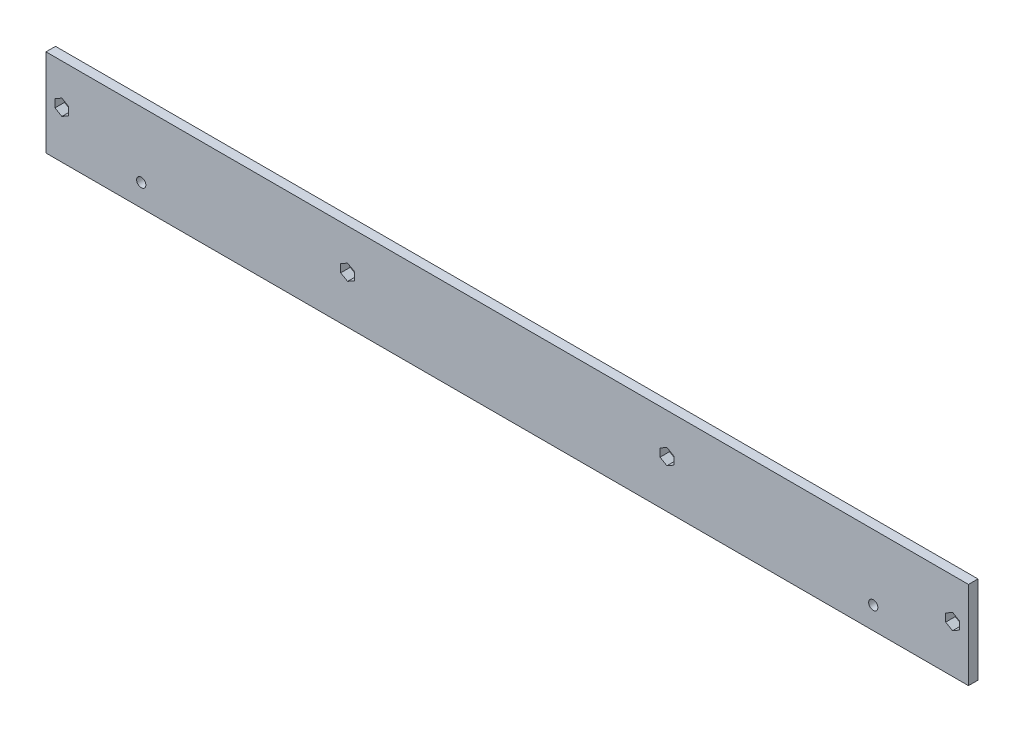
ISO-10303-21;
HEADER;
FILE_DESCRIPTION(('STEP AP214'),'2;1');
FILE_NAME('part.step','',(''),(''),'','','');
FILE_SCHEMA(('AUTOMOTIVE_DESIGN { 1 0 10303 214 1 1 1 1 }'));
ENDSEC;
DATA;
#1=APPLICATION_CONTEXT('core data for automotive mechanical design processes');
#2=APPLICATION_PROTOCOL_DEFINITION('international standard','automotive_design',2000,#1);
#3=PRODUCT_CONTEXT('',#1,'mechanical');
#4=PRODUCT('Part','Part','',(#3));
#5=PRODUCT_RELATED_PRODUCT_CATEGORY('part','',(#4));
#6=PRODUCT_DEFINITION_FORMATION('','',#4);
#7=PRODUCT_DEFINITION_CONTEXT('part definition',#1,'design');
#8=PRODUCT_DEFINITION('design','',#6,#7);
#9=PRODUCT_DEFINITION_SHAPE('','',#8);
#10=(LENGTH_UNIT() NAMED_UNIT(*) SI_UNIT(.MILLI.,.METRE.));
#11=(NAMED_UNIT(*) PLANE_ANGLE_UNIT() SI_UNIT($,.RADIAN.));
#12=(NAMED_UNIT(*) SI_UNIT($,.STERADIAN.) SOLID_ANGLE_UNIT());
#13=UNCERTAINTY_MEASURE_WITH_UNIT(LENGTH_MEASURE(1.E-05),#10,'distance_accuracy_value','');
#14=(GEOMETRIC_REPRESENTATION_CONTEXT(3) GLOBAL_UNCERTAINTY_ASSIGNED_CONTEXT((#13)) GLOBAL_UNIT_ASSIGNED_CONTEXT((#10,
#11,#12)) REPRESENTATION_CONTEXT('',''));
#15=CARTESIAN_POINT('',(0.,0.,0.));
#16=DIRECTION('',(0.,0.,1.));
#17=DIRECTION('',(1.,0.,0.));
#18=AXIS2_PLACEMENT_3D('',#15,#16,#17);
#19=CARTESIAN_POINT('',(-3.92699081749999,0.,3.));
#20=DIRECTION('',(0.,0.,1.));
#21=DIRECTION('',(1.,0.,0.));
#22=AXIS2_PLACEMENT_3D('',#19,#20,#21);
#23=PLANE('',#22);
#24=DIRECTION('',(-0.866025403784439,-0.5,0.));
#25=VECTOR('',#24,1.);
#26=CARTESIAN_POINT('',(3.23807269196111,13.75,3.));
#27=LINE('',#26,#25);
#28=CARTESIAN_POINT('',(3.23807269196111,13.75,3.));
#29=VERTEX_POINT('',#28);
#30=CARTESIAN_POINT('',(1.07300918250001,12.5,3.));
#31=VERTEX_POINT('',#30);
#32=EDGE_CURVE('E225',#29,#31,#27,.T.);
#33=ORIENTED_EDGE('',*,*,#32,.T.);
#34=DIRECTION('',(-0.866025403784439,0.5,0.));
#35=VECTOR('',#34,1.);
#36=CARTESIAN_POINT('',(1.07300918250001,12.5,3.));
#37=LINE('',#36,#35);
#38=CARTESIAN_POINT('',(-1.09205432696108,13.75,3.));
#39=VERTEX_POINT('',#38);
#40=EDGE_CURVE('E236',#31,#39,#37,.T.);
#41=ORIENTED_EDGE('',*,*,#40,.T.);
#42=DIRECTION('',(0.,1.,0.));
#43=VECTOR('',#42,1.);
#44=CARTESIAN_POINT('',(-1.09205432696108,13.75,3.));
#45=LINE('',#44,#43);
#46=CARTESIAN_POINT('',(-1.09205432696108,16.25,3.));
#47=VERTEX_POINT('',#46);
#48=EDGE_CURVE('E51',#39,#47,#45,.T.);
#49=ORIENTED_EDGE('',*,*,#48,.T.);
#50=DIRECTION('',(0.866025403784438,0.500000000000001,0.));
#51=VECTOR('',#50,1.);
#52=CARTESIAN_POINT('',(-1.09205432696108,16.25,3.));
#53=LINE('',#52,#51);
#54=CARTESIAN_POINT('',(1.07300918250001,17.5,3.));
#55=VERTEX_POINT('',#54);
#56=EDGE_CURVE('E250',#47,#55,#53,.T.);
#57=ORIENTED_EDGE('',*,*,#56,.T.);
#58=DIRECTION('',(0.866025403784438,-0.500000000000001,0.));
#59=VECTOR('',#58,1.);
#60=CARTESIAN_POINT('',(1.07300918250001,17.5,3.));
#61=LINE('',#60,#59);
#62=CARTESIAN_POINT('',(3.23807269196111,16.25,3.));
#63=VERTEX_POINT('',#62);
#64=EDGE_CURVE('E253',#55,#63,#61,.T.);
#65=ORIENTED_EDGE('',*,*,#64,.T.);
#66=DIRECTION('',(0.,-1.,0.));
#67=VECTOR('',#66,1.);
#68=CARTESIAN_POINT('',(3.23807269196111,16.25,3.));
#69=LINE('',#68,#67);
#70=EDGE_CURVE('E233',#63,#29,#69,.T.);
#71=ORIENTED_EDGE('',*,*,#70,.T.);
#72=EDGE_LOOP('',(#33,#41,#49,#57,#65,#71));
#73=FACE_BOUND('',#72,.T.);
#74=DIRECTION('',(-0.866025403784438,0.500000000000001,0.));
#75=VECTOR('',#74,1.);
#76=CARTESIAN_POINT('',(91.0730091825,12.5,3.));
#77=LINE('',#76,#75);
#78=CARTESIAN_POINT('',(91.0730091825,12.5,3.));
#79=VERTEX_POINT('',#78);
#80=CARTESIAN_POINT('',(88.9079456730389,13.75,3.));
#81=VERTEX_POINT('',#80);
#82=EDGE_CURVE('E278',#79,#81,#77,.T.);
#83=ORIENTED_EDGE('',*,*,#82,.T.);
#84=DIRECTION('',(0.,1.,0.));
#85=VECTOR('',#84,1.);
#86=CARTESIAN_POINT('',(88.9079456730389,13.75,3.));
#87=LINE('',#86,#85);
#88=CARTESIAN_POINT('',(88.9079456730389,16.25,3.));
#89=VERTEX_POINT('',#88);
#90=EDGE_CURVE('E281',#81,#89,#87,.T.);
#91=ORIENTED_EDGE('',*,*,#90,.T.);
#92=DIRECTION('',(0.866025403784439,0.5,0.));
#93=VECTOR('',#92,1.);
#94=CARTESIAN_POINT('',(88.9079456730389,16.25,3.));
#95=LINE('',#94,#93);
#96=CARTESIAN_POINT('',(91.0730091825,17.5,3.));
#97=VERTEX_POINT('',#96);
#98=EDGE_CURVE('E59',#89,#97,#95,.T.);
#99=ORIENTED_EDGE('',*,*,#98,.T.);
#100=DIRECTION('',(0.866025403784439,-0.499999999999999,0.));
#101=VECTOR('',#100,1.);
#102=CARTESIAN_POINT('',(91.0730091825,17.5,3.));
#103=LINE('',#102,#101);
#104=CARTESIAN_POINT('',(93.2380726919611,16.25,3.));
#105=VERTEX_POINT('',#104);
#106=EDGE_CURVE('E286',#97,#105,#103,.T.);
#107=ORIENTED_EDGE('',*,*,#106,.T.);
#108=DIRECTION('',(0.,-1.,0.));
#109=VECTOR('',#108,1.);
#110=CARTESIAN_POINT('',(93.2380726919611,16.25,3.));
#111=LINE('',#110,#109);
#112=CARTESIAN_POINT('',(93.2380726919611,13.75,3.));
#113=VERTEX_POINT('',#112);
#114=EDGE_CURVE('E289',#105,#113,#111,.T.);
#115=ORIENTED_EDGE('',*,*,#114,.T.);
#116=DIRECTION('',(-0.866025403784439,-0.499999999999999,0.));
#117=VECTOR('',#116,1.);
#118=CARTESIAN_POINT('',(93.2380726919611,13.75,3.));
#119=LINE('',#118,#117);
#120=EDGE_CURVE('E292',#113,#79,#119,.T.);
#121=ORIENTED_EDGE('',*,*,#120,.T.);
#122=EDGE_LOOP('',(#83,#91,#99,#107,#115,#121));
#123=FACE_BOUND('',#122,.T.);
#124=DIRECTION('',(-0.866025403784437,0.500000000000002,0.));
#125=VECTOR('',#124,1.);
#126=CARTESIAN_POINT('',(191.6703296775,12.5,3.));
#127=LINE('',#126,#125);
#128=CARTESIAN_POINT('',(191.6703296775,12.5,3.));
#129=VERTEX_POINT('',#128);
#130=CARTESIAN_POINT('',(189.505266168039,13.75,3.));
#131=VERTEX_POINT('',#130);
#132=EDGE_CURVE('E324',#129,#131,#127,.T.);
#133=ORIENTED_EDGE('',*,*,#132,.T.);
#134=DIRECTION('',(0.,1.,0.));
#135=VECTOR('',#134,1.);
#136=CARTESIAN_POINT('',(189.505266168039,13.75,3.));
#137=LINE('',#136,#135);
#138=CARTESIAN_POINT('',(189.505266168039,16.2500000000001,3.));
#139=VERTEX_POINT('',#138);
#140=EDGE_CURVE('E327',#131,#139,#137,.T.);
#141=ORIENTED_EDGE('',*,*,#140,.T.);
#142=DIRECTION('',(0.866025403784441,0.499999999999996,0.));
#143=VECTOR('',#142,1.);
#144=CARTESIAN_POINT('',(189.505266168039,16.2500000000001,3.));
#145=LINE('',#144,#143);
#146=CARTESIAN_POINT('',(191.6703296775,17.5000000000001,3.));
#147=VERTEX_POINT('',#146);
#148=EDGE_CURVE('E331',#139,#147,#145,.T.);
#149=ORIENTED_EDGE('',*,*,#148,.T.);
#150=DIRECTION('',(0.866025403784438,-0.500000000000001,0.));
#151=VECTOR('',#150,1.);
#152=CARTESIAN_POINT('',(191.6703296775,17.5000000000001,3.));
#153=LINE('',#152,#151);
#154=CARTESIAN_POINT('',(193.835393186961,16.2500000000001,3.));
#155=VERTEX_POINT('',#154);
#156=EDGE_CURVE('E334',#147,#155,#153,.T.);
#157=ORIENTED_EDGE('',*,*,#156,.T.);
#158=DIRECTION('',(0.,-1.,0.));
#159=VECTOR('',#158,1.);
#160=CARTESIAN_POINT('',(193.835393186961,16.2500000000001,3.));
#161=LINE('',#160,#159);
#162=CARTESIAN_POINT('',(193.835393186961,13.7500000000001,3.));
#163=VERTEX_POINT('',#162);
#164=EDGE_CURVE('E337',#155,#163,#161,.T.);
#165=ORIENTED_EDGE('',*,*,#164,.T.);
#166=DIRECTION('',(-0.86602540378444,-0.499999999999998,0.));
#167=VECTOR('',#166,1.);
#168=CARTESIAN_POINT('',(193.835393186961,13.7500000000001,3.));
#169=LINE('',#168,#167);
#170=EDGE_CURVE('E340',#163,#129,#169,.T.);
#171=ORIENTED_EDGE('',*,*,#170,.T.);
#172=EDGE_LOOP('',(#133,#141,#149,#157,#165,#171));
#173=FACE_BOUND('',#172,.T.);
#174=DIRECTION('',(-0.866025403784439,0.499999999999999,0.));
#175=VECTOR('',#174,1.);
#176=CARTESIAN_POINT('',(281.6703296775,12.5000000000001,3.));
#177=LINE('',#176,#175);
#178=CARTESIAN_POINT('',(281.6703296775,12.5000000000001,3.));
#179=VERTEX_POINT('',#178);
#180=CARTESIAN_POINT('',(279.505266168039,13.7500000000001,3.));
#181=VERTEX_POINT('',#180);
#182=EDGE_CURVE('E372',#179,#181,#177,.T.);
#183=ORIENTED_EDGE('',*,*,#182,.T.);
#184=DIRECTION('',(0.,1.,0.));
#185=VECTOR('',#184,1.);
#186=CARTESIAN_POINT('',(279.505266168039,13.7500000000001,3.));
#187=LINE('',#186,#185);
#188=CARTESIAN_POINT('',(279.505266168039,16.2499999999999,3.));
#189=VERTEX_POINT('',#188);
#190=EDGE_CURVE('E375',#181,#189,#187,.T.);
#191=ORIENTED_EDGE('',*,*,#190,.T.);
#192=DIRECTION('',(0.866025403784441,0.499999999999996,0.));
#193=VECTOR('',#192,1.);
#194=CARTESIAN_POINT('',(279.505266168039,16.2499999999999,3.));
#195=LINE('',#194,#193);
#196=CARTESIAN_POINT('',(281.6703296775,17.4999999999999,3.));
#197=VERTEX_POINT('',#196);
#198=EDGE_CURVE('E379',#189,#197,#195,.T.);
#199=ORIENTED_EDGE('',*,*,#198,.T.);
#200=DIRECTION('',(0.866025403784436,-0.500000000000004,0.));
#201=VECTOR('',#200,1.);
#202=CARTESIAN_POINT('',(281.6703296775,17.4999999999999,3.));
#203=LINE('',#202,#201);
#204=CARTESIAN_POINT('',(283.835393186961,16.2499999999999,3.));
#205=VERTEX_POINT('',#204);
#206=EDGE_CURVE('E382',#197,#205,#203,.T.);
#207=ORIENTED_EDGE('',*,*,#206,.T.);
#208=DIRECTION('',(0.,-1.,0.));
#209=VECTOR('',#208,1.);
#210=CARTESIAN_POINT('',(283.835393186961,16.2499999999999,3.));
#211=LINE('',#210,#209);
#212=CARTESIAN_POINT('',(283.835393186961,13.7500000000001,3.));
#213=VERTEX_POINT('',#212);
#214=EDGE_CURVE('E385',#205,#213,#211,.T.);
#215=ORIENTED_EDGE('',*,*,#214,.T.);
#216=DIRECTION('',(-0.866025403784438,-0.500000000000001,0.));
#217=VECTOR('',#216,1.);
#218=CARTESIAN_POINT('',(283.835393186961,13.7500000000001,3.));
#219=LINE('',#218,#217);
#220=EDGE_CURVE('E388',#213,#179,#219,.T.);
#221=ORIENTED_EDGE('',*,*,#220,.T.);
#222=EDGE_LOOP('',(#183,#191,#199,#207,#215,#221));
#223=FACE_BOUND('',#222,.T.);
#224=CARTESIAN_POINT('',(256.6703296775,7.,3.));
#225=DIRECTION('',(0.,0.,1.));
#226=DIRECTION('',(1.,0.,0.));
#227=AXIS2_PLACEMENT_3D('',#224,#225,#226);
#228=CIRCLE('',#227,1.45);
#229=CARTESIAN_POINT('',(258.1203296775,7.,3.));
#230=VERTEX_POINT('',#229);
#231=EDGE_CURVE('E270',#230,#230,#228,.T.);
#232=ORIENTED_EDGE('',*,*,#231,.F.);
#233=EDGE_LOOP('',(#232));
#234=FACE_BOUND('',#233,.T.);
#235=CARTESIAN_POINT('',(26.0730091825,7.,3.));
#236=DIRECTION('',(0.,0.,1.));
#237=DIRECTION('',(1.,0.,0.));
#238=AXIS2_PLACEMENT_3D('',#235,#236,#237);
#239=CIRCLE('',#238,1.45);
#240=CARTESIAN_POINT('',(27.5230091825,7.,3.));
#241=VERTEX_POINT('',#240);
#242=EDGE_CURVE('E422',#241,#241,#239,.T.);
#243=ORIENTED_EDGE('',*,*,#242,.F.);
#244=EDGE_LOOP('',(#243));
#245=FACE_BOUND('',#244,.T.);
#246=DIRECTION('',(0.,-1.,0.));
#247=VECTOR('',#246,1.);
#248=CARTESIAN_POINT('',(-3.92699081749999,27.625,3.));
#249=LINE('',#248,#247);
#250=CARTESIAN_POINT('',(-3.92699081749999,27.625,3.));
#251=VERTEX_POINT('',#250);
#252=CARTESIAN_POINT('',(-3.92699081749999,0.,3.));
#253=VERTEX_POINT('',#252);
#254=EDGE_CURVE('E431',#251,#253,#249,.T.);
#255=ORIENTED_EDGE('',*,*,#254,.T.);
#256=DIRECTION('',(1.,0.,0.));
#257=VECTOR('',#256,1.);
#258=CARTESIAN_POINT('',(-3.92699081749999,0.,3.));
#259=LINE('',#258,#257);
#260=CARTESIAN_POINT('',(286.6703296775,0.,3.));
#261=VERTEX_POINT('',#260);
#262=EDGE_CURVE('E434',#253,#261,#259,.T.);
#263=ORIENTED_EDGE('',*,*,#262,.T.);
#264=DIRECTION('',(0.,1.,0.));
#265=VECTOR('',#264,1.);
#266=CARTESIAN_POINT('',(286.6703296775,27.625,3.));
#267=LINE('',#266,#265);
#268=CARTESIAN_POINT('',(286.6703296775,27.625,3.));
#269=VERTEX_POINT('',#268);
#270=EDGE_CURVE('E437',#261,#269,#267,.T.);
#271=ORIENTED_EDGE('',*,*,#270,.T.);
#272=DIRECTION('',(-1.,0.,0.));
#273=VECTOR('',#272,1.);
#274=CARTESIAN_POINT('',(-3.92699081749999,27.625,3.));
#275=LINE('',#274,#273);
#276=EDGE_CURVE('E439',#269,#251,#275,.T.);
#277=ORIENTED_EDGE('',*,*,#276,.T.);
#278=EDGE_LOOP('',(#255,#263,#271,#277));
#279=FACE_BOUND('',#278,.T.);
#280=ADVANCED_FACE('F36',(#73,#123,#173,#223,#234,#245,#279),#23,.T.);
#281=CARTESIAN_POINT('',(-3.92699081749999,0.,0.));
#282=DIRECTION('',(0.,0.,1.));
#283=DIRECTION('',(1.,0.,0.));
#284=AXIS2_PLACEMENT_3D('',#281,#282,#283);
#285=PLANE('',#284);
#286=DIRECTION('',(-0.866025403784439,0.5,0.));
#287=VECTOR('',#286,1.);
#288=CARTESIAN_POINT('',(1.07300918250001,12.5,0.));
#289=LINE('',#288,#287);
#290=CARTESIAN_POINT('',(1.07300918250001,12.5,0.));
#291=VERTEX_POINT('',#290);
#292=CARTESIAN_POINT('',(-1.09205432696108,13.75,0.));
#293=VERTEX_POINT('',#292);
#294=EDGE_CURVE('E257',#291,#293,#289,.T.);
#295=ORIENTED_EDGE('',*,*,#294,.F.);
#296=DIRECTION('',(-0.866025403784439,-0.5,0.));
#297=VECTOR('',#296,1.);
#298=CARTESIAN_POINT('',(3.23807269196111,13.75,0.));
#299=LINE('',#298,#297);
#300=CARTESIAN_POINT('',(3.23807269196111,13.75,0.));
#301=VERTEX_POINT('',#300);
#302=EDGE_CURVE('E228',#301,#291,#299,.T.);
#303=ORIENTED_EDGE('',*,*,#302,.F.);
#304=DIRECTION('',(0.,-1.,0.));
#305=VECTOR('',#304,1.);
#306=CARTESIAN_POINT('',(3.23807269196111,16.25,0.));
#307=LINE('',#306,#305);
#308=CARTESIAN_POINT('',(3.23807269196111,16.25,0.));
#309=VERTEX_POINT('',#308);
#310=EDGE_CURVE('E243',#309,#301,#307,.T.);
#311=ORIENTED_EDGE('',*,*,#310,.F.);
#312=DIRECTION('',(0.866025403784438,-0.500000000000001,0.));
#313=VECTOR('',#312,1.);
#314=CARTESIAN_POINT('',(1.07300918250001,17.5,0.));
#315=LINE('',#314,#313);
#316=CARTESIAN_POINT('',(1.07300918250001,17.5,0.));
#317=VERTEX_POINT('',#316);
#318=EDGE_CURVE('E246',#317,#309,#315,.T.);
#319=ORIENTED_EDGE('',*,*,#318,.F.);
#320=DIRECTION('',(0.866025403784438,0.500000000000001,0.));
#321=VECTOR('',#320,1.);
#322=CARTESIAN_POINT('',(-1.09205432696108,16.25,0.));
#323=LINE('',#322,#321);
#324=CARTESIAN_POINT('',(-1.09205432696108,16.25,0.));
#325=VERTEX_POINT('',#324);
#326=EDGE_CURVE('E263',#325,#317,#323,.T.);
#327=ORIENTED_EDGE('',*,*,#326,.F.);
#328=DIRECTION('',(0.,1.,0.));
#329=VECTOR('',#328,1.);
#330=CARTESIAN_POINT('',(-1.09205432696108,13.75,0.));
#331=LINE('',#330,#329);
#332=EDGE_CURVE('E260',#293,#325,#331,.T.);
#333=ORIENTED_EDGE('',*,*,#332,.F.);
#334=EDGE_LOOP('',(#295,#303,#311,#319,#327,#333));
#335=FACE_BOUND('',#334,.T.);
#336=DIRECTION('',(0.,1.,0.));
#337=VECTOR('',#336,1.);
#338=CARTESIAN_POINT('',(88.9079456730389,13.75,0.));
#339=LINE('',#338,#337);
#340=CARTESIAN_POINT('',(88.9079456730389,13.75,0.));
#341=VERTEX_POINT('',#340);
#342=CARTESIAN_POINT('',(88.9079456730389,16.25,0.));
#343=VERTEX_POINT('',#342);
#344=EDGE_CURVE('E298',#341,#343,#339,.T.);
#345=ORIENTED_EDGE('',*,*,#344,.F.);
#346=DIRECTION('',(-0.866025403784438,0.500000000000001,0.));
#347=VECTOR('',#346,1.);
#348=CARTESIAN_POINT('',(91.0730091825,12.5,0.));
#349=LINE('',#348,#347);
#350=CARTESIAN_POINT('',(91.0730091825,12.5,0.));
#351=VERTEX_POINT('',#350);
#352=EDGE_CURVE('E296',#351,#341,#349,.T.);
#353=ORIENTED_EDGE('',*,*,#352,.F.);
#354=DIRECTION('',(-0.866025403784439,-0.499999999999999,0.));
#355=VECTOR('',#354,1.);
#356=CARTESIAN_POINT('',(93.2380726919611,13.75,0.));
#357=LINE('',#356,#355);
#358=CARTESIAN_POINT('',(93.2380726919611,13.75,0.));
#359=VERTEX_POINT('',#358);
#360=EDGE_CURVE('E282',#359,#351,#357,.T.);
#361=ORIENTED_EDGE('',*,*,#360,.F.);
#362=DIRECTION('',(0.,-1.,0.));
#363=VECTOR('',#362,1.);
#364=CARTESIAN_POINT('',(93.2380726919611,16.25,0.));
#365=LINE('',#364,#363);
#366=CARTESIAN_POINT('',(93.2380726919611,16.25,0.));
#367=VERTEX_POINT('',#366);
#368=EDGE_CURVE('E308',#367,#359,#365,.T.);
#369=ORIENTED_EDGE('',*,*,#368,.F.);
#370=DIRECTION('',(0.866025403784439,-0.499999999999999,0.));
#371=VECTOR('',#370,1.);
#372=CARTESIAN_POINT('',(91.0730091825,17.5,0.));
#373=LINE('',#372,#371);
#374=CARTESIAN_POINT('',(91.0730091825,17.5,0.));
#375=VERTEX_POINT('',#374);
#376=EDGE_CURVE('E305',#375,#367,#373,.T.);
#377=ORIENTED_EDGE('',*,*,#376,.F.);
#378=DIRECTION('',(0.866025403784439,0.5,0.));
#379=VECTOR('',#378,1.);
#380=CARTESIAN_POINT('',(88.9079456730389,16.25,0.));
#381=LINE('',#380,#379);
#382=EDGE_CURVE('E302',#343,#375,#381,.T.);
#383=ORIENTED_EDGE('',*,*,#382,.F.);
#384=EDGE_LOOP('',(#345,#353,#361,#369,#377,#383));
#385=FACE_BOUND('',#384,.T.);
#386=DIRECTION('',(0.,1.,0.));
#387=VECTOR('',#386,1.);
#388=CARTESIAN_POINT('',(189.505266168039,13.75,0.));
#389=LINE('',#388,#387);
#390=CARTESIAN_POINT('',(189.505266168039,13.75,0.));
#391=VERTEX_POINT('',#390);
#392=CARTESIAN_POINT('',(189.505266168039,16.2500000000001,0.));
#393=VERTEX_POINT('',#392);
#394=EDGE_CURVE('E346',#391,#393,#389,.T.);
#395=ORIENTED_EDGE('',*,*,#394,.F.);
#396=DIRECTION('',(-0.866025403784437,0.500000000000002,0.));
#397=VECTOR('',#396,1.);
#398=CARTESIAN_POINT('',(191.6703296775,12.5,0.));
#399=LINE('',#398,#397);
#400=CARTESIAN_POINT('',(191.6703296775,12.5,0.));
#401=VERTEX_POINT('',#400);
#402=EDGE_CURVE('E344',#401,#391,#399,.T.);
#403=ORIENTED_EDGE('',*,*,#402,.F.);
#404=DIRECTION('',(-0.86602540378444,-0.499999999999998,0.));
#405=VECTOR('',#404,1.);
#406=CARTESIAN_POINT('',(193.835393186961,13.7500000000001,0.));
#407=LINE('',#406,#405);
#408=CARTESIAN_POINT('',(193.835393186961,13.7500000000001,0.));
#409=VERTEX_POINT('',#408);
#410=EDGE_CURVE('E328',#409,#401,#407,.T.);
#411=ORIENTED_EDGE('',*,*,#410,.F.);
#412=DIRECTION('',(0.,-1.,0.));
#413=VECTOR('',#412,1.);
#414=CARTESIAN_POINT('',(193.835393186961,16.2500000000001,0.));
#415=LINE('',#414,#413);
#416=CARTESIAN_POINT('',(193.835393186961,16.2500000000001,0.));
#417=VERTEX_POINT('',#416);
#418=EDGE_CURVE('E356',#417,#409,#415,.T.);
#419=ORIENTED_EDGE('',*,*,#418,.F.);
#420=DIRECTION('',(0.866025403784438,-0.500000000000001,0.));
#421=VECTOR('',#420,1.);
#422=CARTESIAN_POINT('',(191.6703296775,17.5000000000001,0.));
#423=LINE('',#422,#421);
#424=CARTESIAN_POINT('',(191.6703296775,17.5000000000001,0.));
#425=VERTEX_POINT('',#424);
#426=EDGE_CURVE('E353',#425,#417,#423,.T.);
#427=ORIENTED_EDGE('',*,*,#426,.F.);
#428=DIRECTION('',(0.866025403784441,0.499999999999996,0.));
#429=VECTOR('',#428,1.);
#430=CARTESIAN_POINT('',(189.505266168039,16.2500000000001,0.));
#431=LINE('',#430,#429);
#432=EDGE_CURVE('E350',#393,#425,#431,.T.);
#433=ORIENTED_EDGE('',*,*,#432,.F.);
#434=EDGE_LOOP('',(#395,#403,#411,#419,#427,#433));
#435=FACE_BOUND('',#434,.T.);
#436=DIRECTION('',(0.,1.,0.));
#437=VECTOR('',#436,1.);
#438=CARTESIAN_POINT('',(279.505266168039,13.7500000000001,0.));
#439=LINE('',#438,#437);
#440=CARTESIAN_POINT('',(279.505266168039,13.7500000000001,0.));
#441=VERTEX_POINT('',#440);
#442=CARTESIAN_POINT('',(279.505266168039,16.2499999999999,0.));
#443=VERTEX_POINT('',#442);
#444=EDGE_CURVE('E394',#441,#443,#439,.T.);
#445=ORIENTED_EDGE('',*,*,#444,.F.);
#446=DIRECTION('',(-0.866025403784439,0.499999999999999,0.));
#447=VECTOR('',#446,1.);
#448=CARTESIAN_POINT('',(281.6703296775,12.5000000000001,0.));
#449=LINE('',#448,#447);
#450=CARTESIAN_POINT('',(281.6703296775,12.5000000000001,0.));
#451=VERTEX_POINT('',#450);
#452=EDGE_CURVE('E392',#451,#441,#449,.T.);
#453=ORIENTED_EDGE('',*,*,#452,.F.);
#454=DIRECTION('',(-0.866025403784438,-0.500000000000001,0.));
#455=VECTOR('',#454,1.);
#456=CARTESIAN_POINT('',(283.835393186961,13.7500000000001,0.));
#457=LINE('',#456,#455);
#458=CARTESIAN_POINT('',(283.835393186961,13.7500000000001,0.));
#459=VERTEX_POINT('',#458);
#460=EDGE_CURVE('E376',#459,#451,#457,.T.);
#461=ORIENTED_EDGE('',*,*,#460,.F.);
#462=DIRECTION('',(0.,-1.,0.));
#463=VECTOR('',#462,1.);
#464=CARTESIAN_POINT('',(283.835393186961,16.2499999999999,0.));
#465=LINE('',#464,#463);
#466=CARTESIAN_POINT('',(283.835393186961,16.2499999999999,0.));
#467=VERTEX_POINT('',#466);
#468=EDGE_CURVE('E403',#467,#459,#465,.T.);
#469=ORIENTED_EDGE('',*,*,#468,.F.);
#470=DIRECTION('',(0.866025403784436,-0.500000000000004,0.));
#471=VECTOR('',#470,1.);
#472=CARTESIAN_POINT('',(281.6703296775,17.4999999999999,0.));
#473=LINE('',#472,#471);
#474=CARTESIAN_POINT('',(281.6703296775,17.4999999999999,0.));
#475=VERTEX_POINT('',#474);
#476=EDGE_CURVE('E400',#475,#467,#473,.T.);
#477=ORIENTED_EDGE('',*,*,#476,.F.);
#478=DIRECTION('',(0.866025403784441,0.499999999999996,0.));
#479=VECTOR('',#478,1.);
#480=CARTESIAN_POINT('',(279.505266168039,16.2499999999999,0.));
#481=LINE('',#480,#479);
#482=EDGE_CURVE('E397',#443,#475,#481,.T.);
#483=ORIENTED_EDGE('',*,*,#482,.F.);
#484=EDGE_LOOP('',(#445,#453,#461,#469,#477,#483));
#485=FACE_BOUND('',#484,.T.);
#486=CARTESIAN_POINT('',(256.6703296775,7.,0.));
#487=DIRECTION('',(0.,0.,1.));
#488=DIRECTION('',(1.,0.,0.));
#489=AXIS2_PLACEMENT_3D('',#486,#487,#488);
#490=CIRCLE('',#489,1.45);
#491=CARTESIAN_POINT('',(258.1203296775,7.,0.));
#492=VERTEX_POINT('',#491);
#493=EDGE_CURVE('E419',#492,#492,#490,.T.);
#494=ORIENTED_EDGE('',*,*,#493,.T.);
#495=EDGE_LOOP('',(#494));
#496=FACE_BOUND('',#495,.T.);
#497=CARTESIAN_POINT('',(26.0730091825,7.,0.));
#498=DIRECTION('',(0.,0.,1.));
#499=DIRECTION('',(1.,0.,0.));
#500=AXIS2_PLACEMENT_3D('',#497,#498,#499);
#501=CIRCLE('',#500,1.45);
#502=CARTESIAN_POINT('',(27.5230091825,7.,0.));
#503=VERTEX_POINT('',#502);
#504=EDGE_CURVE('E425',#503,#503,#501,.T.);
#505=ORIENTED_EDGE('',*,*,#504,.T.);
#506=EDGE_LOOP('',(#505));
#507=FACE_BOUND('',#506,.T.);
#508=DIRECTION('',(0.,-1.,0.));
#509=VECTOR('',#508,1.);
#510=CARTESIAN_POINT('',(-3.92699081749999,27.625,0.));
#511=LINE('',#510,#509);
#512=CARTESIAN_POINT('',(-3.92699081749999,27.625,0.));
#513=VERTEX_POINT('',#512);
#514=CARTESIAN_POINT('',(-3.92699081749999,0.,0.));
#515=VERTEX_POINT('',#514);
#516=EDGE_CURVE('E428',#513,#515,#511,.T.);
#517=ORIENTED_EDGE('',*,*,#516,.F.);
#518=DIRECTION('',(-1.,0.,0.));
#519=VECTOR('',#518,1.);
#520=CARTESIAN_POINT('',(-3.92699081749999,27.625,0.));
#521=LINE('',#520,#519);
#522=CARTESIAN_POINT('',(286.6703296775,27.625,0.));
#523=VERTEX_POINT('',#522);
#524=EDGE_CURVE('E435',#523,#513,#521,.T.);
#525=ORIENTED_EDGE('',*,*,#524,.F.);
#526=DIRECTION('',(0.,1.,0.));
#527=VECTOR('',#526,1.);
#528=CARTESIAN_POINT('',(286.6703296775,27.625,0.));
#529=LINE('',#528,#527);
#530=CARTESIAN_POINT('',(286.6703296775,0.,0.));
#531=VERTEX_POINT('',#530);
#532=EDGE_CURVE('E446',#531,#523,#529,.T.);
#533=ORIENTED_EDGE('',*,*,#532,.F.);
#534=DIRECTION('',(1.,0.,0.));
#535=VECTOR('',#534,1.);
#536=CARTESIAN_POINT('',(-3.92699081749999,0.,0.));
#537=LINE('',#536,#535);
#538=EDGE_CURVE('E444',#515,#531,#537,.T.);
#539=ORIENTED_EDGE('',*,*,#538,.F.);
#540=EDGE_LOOP('',(#517,#525,#533,#539));
#541=FACE_BOUND('',#540,.T.);
#542=ADVANCED_FACE('F464',(#335,#385,#435,#485,#496,#507,#541),#285,.F.);
#543=CARTESIAN_POINT('',(-3.92699081749999,27.625,3.));
#544=DIRECTION('',(1.,0.,0.));
#545=DIRECTION('',(0.,0.,-1.));
#546=AXIS2_PLACEMENT_3D('',#543,#544,#545);
#547=PLANE('',#546);
#548=ORIENTED_EDGE('',*,*,#516,.T.);
#549=DIRECTION('',(0.,0.,-1.));
#550=VECTOR('',#549,1.);
#551=CARTESIAN_POINT('',(-3.92699081749999,0.,3.));
#552=LINE('',#551,#550);
#553=EDGE_CURVE('E11',#253,#515,#552,.T.);
#554=ORIENTED_EDGE('',*,*,#553,.F.);
#555=ORIENTED_EDGE('',*,*,#254,.F.);
#556=DIRECTION('',(0.,0.,-1.));
#557=VECTOR('',#556,1.);
#558=CARTESIAN_POINT('',(-3.92699081749999,27.625,3.));
#559=LINE('',#558,#557);
#560=EDGE_CURVE('E441',#251,#513,#559,.T.);
#561=ORIENTED_EDGE('',*,*,#560,.T.);
#562=EDGE_LOOP('',(#548,#554,#555,#561));
#563=FACE_BOUND('',#562,.T.);
#564=ADVANCED_FACE('F38',(#563),#547,.F.);
#565=CARTESIAN_POINT('',(-3.92699081749999,0.,3.));
#566=DIRECTION('',(0.,1.,0.));
#567=DIRECTION('',(0.,0.,1.));
#568=AXIS2_PLACEMENT_3D('',#565,#566,#567);
#569=PLANE('',#568);
#570=ORIENTED_EDGE('',*,*,#538,.T.);
#571=DIRECTION('',(0.,0.,-1.));
#572=VECTOR('',#571,1.);
#573=CARTESIAN_POINT('',(286.6703296775,0.,3.));
#574=LINE('',#573,#572);
#575=EDGE_CURVE('E44',#261,#531,#574,.T.);
#576=ORIENTED_EDGE('',*,*,#575,.F.);
#577=ORIENTED_EDGE('',*,*,#262,.F.);
#578=ORIENTED_EDGE('',*,*,#553,.T.);
#579=EDGE_LOOP('',(#570,#576,#577,#578));
#580=FACE_BOUND('',#579,.T.);
#581=ADVANCED_FACE('F473',(#580),#569,.F.);
#582=CARTESIAN_POINT('',(286.6703296775,27.625,3.));
#583=DIRECTION('',(-1.,0.,0.));
#584=DIRECTION('',(0.,0.,1.));
#585=AXIS2_PLACEMENT_3D('',#582,#583,#584);
#586=PLANE('',#585);
#587=ORIENTED_EDGE('',*,*,#532,.T.);
#588=DIRECTION('',(0.,0.,-1.));
#589=VECTOR('',#588,1.);
#590=CARTESIAN_POINT('',(286.6703296775,27.625,3.));
#591=LINE('',#590,#589);
#592=EDGE_CURVE('E451',#269,#523,#591,.T.);
#593=ORIENTED_EDGE('',*,*,#592,.F.);
#594=ORIENTED_EDGE('',*,*,#270,.F.);
#595=ORIENTED_EDGE('',*,*,#575,.T.);
#596=EDGE_LOOP('',(#587,#593,#594,#595));
#597=FACE_BOUND('',#596,.T.);
#598=ADVANCED_FACE('F458',(#597),#586,.F.);
#599=CARTESIAN_POINT('',(-3.92699081749999,27.625,3.));
#600=DIRECTION('',(0.,-1.,0.));
#601=DIRECTION('',(0.,0.,-1.));
#602=AXIS2_PLACEMENT_3D('',#599,#600,#601);
#603=PLANE('',#602);
#604=ORIENTED_EDGE('',*,*,#524,.T.);
#605=ORIENTED_EDGE('',*,*,#560,.F.);
#606=ORIENTED_EDGE('',*,*,#276,.F.);
#607=ORIENTED_EDGE('',*,*,#592,.T.);
#608=EDGE_LOOP('',(#604,#605,#606,#607));
#609=FACE_BOUND('',#608,.T.);
#610=ADVANCED_FACE('F467',(#609),#603,.F.);
#611=CARTESIAN_POINT('',(26.0730091825,7.,0.));
#612=DIRECTION('',(0.,0.,1.));
#613=DIRECTION('',(1.,0.,0.));
#614=AXIS2_PLACEMENT_3D('',#611,#612,#613);
#615=CYLINDRICAL_SURFACE('',#614,1.45);
#616=ORIENTED_EDGE('',*,*,#504,.F.);
#617=EDGE_LOOP('',(#616));
#618=FACE_BOUND('',#617,.T.);
#619=ORIENTED_EDGE('',*,*,#242,.T.);
#620=EDGE_LOOP('',(#619));
#621=FACE_BOUND('',#620,.T.);
#622=ADVANCED_FACE('F488',(#618,#621),#615,.F.);
#623=CARTESIAN_POINT('',(256.6703296775,7.,0.));
#624=DIRECTION('',(0.,0.,1.));
#625=DIRECTION('',(1.,0.,0.));
#626=AXIS2_PLACEMENT_3D('',#623,#624,#625);
#627=CYLINDRICAL_SURFACE('',#626,1.45);
#628=ORIENTED_EDGE('',*,*,#493,.F.);
#629=EDGE_LOOP('',(#628));
#630=FACE_BOUND('',#629,.T.);
#631=ORIENTED_EDGE('',*,*,#231,.T.);
#632=EDGE_LOOP('',(#631));
#633=FACE_BOUND('',#632,.T.);
#634=ADVANCED_FACE('F495',(#630,#633),#627,.F.);
#635=CARTESIAN_POINT('',(281.6703296775,12.5000000000001,3.));
#636=DIRECTION('',(-0.499999999999999,-0.866025403784439,0.));
#637=DIRECTION('',(0.866025403784439,-0.499999999999999,0.));
#638=AXIS2_PLACEMENT_3D('',#635,#636,#637);
#639=PLANE('',#638);
#640=ORIENTED_EDGE('',*,*,#452,.T.);
#641=DIRECTION('',(0.,0.,-1.));
#642=VECTOR('',#641,1.);
#643=CARTESIAN_POINT('',(279.505266168039,13.7500000000001,3.));
#644=LINE('',#643,#642);
#645=EDGE_CURVE('E391',#181,#441,#644,.T.);
#646=ORIENTED_EDGE('',*,*,#645,.F.);
#647=ORIENTED_EDGE('',*,*,#182,.F.);
#648=DIRECTION('',(0.,0.,-1.));
#649=VECTOR('',#648,1.);
#650=CARTESIAN_POINT('',(281.6703296775,12.5000000000001,3.));
#651=LINE('',#650,#649);
#652=EDGE_CURVE('E347',#179,#451,#651,.T.);
#653=ORIENTED_EDGE('',*,*,#652,.T.);
#654=EDGE_LOOP('',(#640,#646,#647,#653));
#655=FACE_BOUND('',#654,.T.);
#656=ADVANCED_FACE('F500',(#655),#639,.F.);
#657=CARTESIAN_POINT('',(283.835393186961,13.7500000000001,3.));
#658=DIRECTION('',(0.500000000000001,-0.866025403784438,0.));
#659=DIRECTION('',(0.866025403784438,0.500000000000001,0.));
#660=AXIS2_PLACEMENT_3D('',#657,#658,#659);
#661=PLANE('',#660);
#662=ORIENTED_EDGE('',*,*,#460,.T.);
#663=ORIENTED_EDGE('',*,*,#652,.F.);
#664=ORIENTED_EDGE('',*,*,#220,.F.);
#665=DIRECTION('',(0.,0.,-1.));
#666=VECTOR('',#665,1.);
#667=CARTESIAN_POINT('',(283.835393186961,13.7500000000001,3.));
#668=LINE('',#667,#666);
#669=EDGE_CURVE('E409',#213,#459,#668,.T.);
#670=ORIENTED_EDGE('',*,*,#669,.T.);
#671=EDGE_LOOP('',(#662,#663,#664,#670));
#672=FACE_BOUND('',#671,.T.);
#673=ADVANCED_FACE('F510',(#672),#661,.F.);
#674=CARTESIAN_POINT('',(283.835393186961,16.2499999999999,3.));
#675=DIRECTION('',(1.,0.,0.));
#676=DIRECTION('',(0.,0.,-1.));
#677=AXIS2_PLACEMENT_3D('',#674,#675,#676);
#678=PLANE('',#677);
#679=ORIENTED_EDGE('',*,*,#468,.T.);
#680=ORIENTED_EDGE('',*,*,#669,.F.);
#681=ORIENTED_EDGE('',*,*,#214,.F.);
#682=DIRECTION('',(0.,0.,-1.));
#683=VECTOR('',#682,1.);
#684=CARTESIAN_POINT('',(283.835393186961,16.2499999999999,3.));
#685=LINE('',#684,#683);
#686=EDGE_CURVE('E411',#205,#467,#685,.T.);
#687=ORIENTED_EDGE('',*,*,#686,.T.);
#688=EDGE_LOOP('',(#679,#680,#681,#687));
#689=FACE_BOUND('',#688,.T.);
#690=ADVANCED_FACE('F528',(#689),#678,.F.);
#691=CARTESIAN_POINT('',(281.6703296775,17.4999999999999,3.));
#692=DIRECTION('',(0.500000000000004,0.866025403784436,0.));
#693=DIRECTION('',(-0.866025403784436,0.500000000000004,0.));
#694=AXIS2_PLACEMENT_3D('',#691,#692,#693);
#695=PLANE('',#694);
#696=ORIENTED_EDGE('',*,*,#476,.T.);
#697=ORIENTED_EDGE('',*,*,#686,.F.);
#698=ORIENTED_EDGE('',*,*,#206,.F.);
#699=DIRECTION('',(0.,0.,-1.));
#700=VECTOR('',#699,1.);
#701=CARTESIAN_POINT('',(281.6703296775,17.4999999999999,3.));
#702=LINE('',#701,#700);
#703=EDGE_CURVE('E413',#197,#475,#702,.T.);
#704=ORIENTED_EDGE('',*,*,#703,.T.);
#705=EDGE_LOOP('',(#696,#697,#698,#704));
#706=FACE_BOUND('',#705,.T.);
#707=ADVANCED_FACE('F524',(#706),#695,.F.);
#708=CARTESIAN_POINT('',(279.505266168039,16.2499999999999,3.));
#709=DIRECTION('',(-0.499999999999996,0.866025403784441,0.));
#710=DIRECTION('',(-0.866025403784441,-0.499999999999996,0.));
#711=AXIS2_PLACEMENT_3D('',#708,#709,#710);
#712=PLANE('',#711);
#713=ORIENTED_EDGE('',*,*,#482,.T.);
#714=ORIENTED_EDGE('',*,*,#703,.F.);
#715=ORIENTED_EDGE('',*,*,#198,.F.);
#716=DIRECTION('',(0.,0.,-1.));
#717=VECTOR('',#716,1.);
#718=CARTESIAN_POINT('',(279.505266168039,16.2499999999999,3.));
#719=LINE('',#718,#717);
#720=EDGE_CURVE('E415',#189,#443,#719,.T.);
#721=ORIENTED_EDGE('',*,*,#720,.T.);
#722=EDGE_LOOP('',(#713,#714,#715,#721));
#723=FACE_BOUND('',#722,.T.);
#724=ADVANCED_FACE('F520',(#723),#712,.F.);
#725=CARTESIAN_POINT('',(279.505266168039,13.7500000000001,3.));
#726=DIRECTION('',(-1.,0.,0.));
#727=DIRECTION('',(0.,0.,1.));
#728=AXIS2_PLACEMENT_3D('',#725,#726,#727);
#729=PLANE('',#728);
#730=ORIENTED_EDGE('',*,*,#444,.T.);
#731=ORIENTED_EDGE('',*,*,#720,.F.);
#732=ORIENTED_EDGE('',*,*,#190,.F.);
#733=ORIENTED_EDGE('',*,*,#645,.T.);
#734=EDGE_LOOP('',(#730,#731,#732,#733));
#735=FACE_BOUND('',#734,.T.);
#736=ADVANCED_FACE('F516',(#735),#729,.F.);
#737=CARTESIAN_POINT('',(191.6703296775,12.5,3.));
#738=DIRECTION('',(-0.500000000000002,-0.866025403784437,0.));
#739=DIRECTION('',(0.866025403784437,-0.500000000000002,0.));
#740=AXIS2_PLACEMENT_3D('',#737,#738,#739);
#741=PLANE('',#740);
#742=ORIENTED_EDGE('',*,*,#402,.T.);
#743=DIRECTION('',(0.,0.,-1.));
#744=VECTOR('',#743,1.);
#745=CARTESIAN_POINT('',(189.505266168039,13.75,3.));
#746=LINE('',#745,#744);
#747=EDGE_CURVE('E343',#131,#391,#746,.T.);
#748=ORIENTED_EDGE('',*,*,#747,.F.);
#749=ORIENTED_EDGE('',*,*,#132,.F.);
#750=DIRECTION('',(0.,0.,-1.));
#751=VECTOR('',#750,1.);
#752=CARTESIAN_POINT('',(191.6703296775,12.5,3.));
#753=LINE('',#752,#751);
#754=EDGE_CURVE('E299',#129,#401,#753,.T.);
#755=ORIENTED_EDGE('',*,*,#754,.T.);
#756=EDGE_LOOP('',(#742,#748,#749,#755));
#757=FACE_BOUND('',#756,.T.);
#758=ADVANCED_FACE('F519',(#757),#741,.F.);
#759=CARTESIAN_POINT('',(193.835393186961,13.7500000000001,3.));
#760=DIRECTION('',(0.499999999999998,-0.86602540378444,0.));
#761=DIRECTION('',(0.86602540378444,0.499999999999998,0.));
#762=AXIS2_PLACEMENT_3D('',#759,#760,#761);
#763=PLANE('',#762);
#764=ORIENTED_EDGE('',*,*,#410,.T.);
#765=ORIENTED_EDGE('',*,*,#754,.F.);
#766=ORIENTED_EDGE('',*,*,#170,.F.);
#767=DIRECTION('',(0.,0.,-1.));
#768=VECTOR('',#767,1.);
#769=CARTESIAN_POINT('',(193.835393186961,13.7500000000001,3.));
#770=LINE('',#769,#768);
#771=EDGE_CURVE('E362',#163,#409,#770,.T.);
#772=ORIENTED_EDGE('',*,*,#771,.T.);
#773=EDGE_LOOP('',(#764,#765,#766,#772));
#774=FACE_BOUND('',#773,.T.);
#775=ADVANCED_FACE('F538',(#774),#763,.F.);
#776=CARTESIAN_POINT('',(193.835393186961,16.2500000000001,3.));
#777=DIRECTION('',(1.,0.,0.));
#778=DIRECTION('',(0.,0.,-1.));
#779=AXIS2_PLACEMENT_3D('',#776,#777,#778);
#780=PLANE('',#779);
#781=ORIENTED_EDGE('',*,*,#418,.T.);
#782=ORIENTED_EDGE('',*,*,#771,.F.);
#783=ORIENTED_EDGE('',*,*,#164,.F.);
#784=DIRECTION('',(0.,0.,-1.));
#785=VECTOR('',#784,1.);
#786=CARTESIAN_POINT('',(193.835393186961,16.2500000000001,3.));
#787=LINE('',#786,#785);
#788=EDGE_CURVE('E364',#155,#417,#787,.T.);
#789=ORIENTED_EDGE('',*,*,#788,.T.);
#790=EDGE_LOOP('',(#781,#782,#783,#789));
#791=FACE_BOUND('',#790,.T.);
#792=ADVANCED_FACE('F552',(#791),#780,.F.);
#793=CARTESIAN_POINT('',(191.6703296775,17.5000000000001,3.));
#794=DIRECTION('',(0.500000000000001,0.866025403784438,0.));
#795=DIRECTION('',(-0.866025403784438,0.500000000000001,0.));
#796=AXIS2_PLACEMENT_3D('',#793,#794,#795);
#797=PLANE('',#796);
#798=ORIENTED_EDGE('',*,*,#426,.T.);
#799=ORIENTED_EDGE('',*,*,#788,.F.);
#800=ORIENTED_EDGE('',*,*,#156,.F.);
#801=DIRECTION('',(0.,0.,-1.));
#802=VECTOR('',#801,1.);
#803=CARTESIAN_POINT('',(191.6703296775,17.5000000000001,3.));
#804=LINE('',#803,#802);
#805=EDGE_CURVE('E366',#147,#425,#804,.T.);
#806=ORIENTED_EDGE('',*,*,#805,.T.);
#807=EDGE_LOOP('',(#798,#799,#800,#806));
#808=FACE_BOUND('',#807,.T.);
#809=ADVANCED_FACE('F548',(#808),#797,.F.);
#810=CARTESIAN_POINT('',(189.505266168039,16.2500000000001,3.));
#811=DIRECTION('',(-0.499999999999996,0.866025403784441,0.));
#812=DIRECTION('',(-0.866025403784441,-0.499999999999996,0.));
#813=AXIS2_PLACEMENT_3D('',#810,#811,#812);
#814=PLANE('',#813);
#815=ORIENTED_EDGE('',*,*,#432,.T.);
#816=ORIENTED_EDGE('',*,*,#805,.F.);
#817=ORIENTED_EDGE('',*,*,#148,.F.);
#818=DIRECTION('',(0.,0.,-1.));
#819=VECTOR('',#818,1.);
#820=CARTESIAN_POINT('',(189.505266168039,16.2500000000001,3.));
#821=LINE('',#820,#819);
#822=EDGE_CURVE('E368',#139,#393,#821,.T.);
#823=ORIENTED_EDGE('',*,*,#822,.T.);
#824=EDGE_LOOP('',(#815,#816,#817,#823));
#825=FACE_BOUND('',#824,.T.);
#826=ADVANCED_FACE('F544',(#825),#814,.F.);
#827=CARTESIAN_POINT('',(189.505266168039,13.75,3.));
#828=DIRECTION('',(-1.,0.,0.));
#829=DIRECTION('',(0.,0.,1.));
#830=AXIS2_PLACEMENT_3D('',#827,#828,#829);
#831=PLANE('',#830);
#832=ORIENTED_EDGE('',*,*,#394,.T.);
#833=ORIENTED_EDGE('',*,*,#822,.F.);
#834=ORIENTED_EDGE('',*,*,#140,.F.);
#835=ORIENTED_EDGE('',*,*,#747,.T.);
#836=EDGE_LOOP('',(#832,#833,#834,#835));
#837=FACE_BOUND('',#836,.T.);
#838=ADVANCED_FACE('F540',(#837),#831,.F.);
#839=CARTESIAN_POINT('',(91.0730091825,12.5,3.));
#840=DIRECTION('',(-0.500000000000001,-0.866025403784438,0.));
#841=DIRECTION('',(0.866025403784438,-0.500000000000001,0.));
#842=AXIS2_PLACEMENT_3D('',#839,#840,#841);
#843=PLANE('',#842);
#844=ORIENTED_EDGE('',*,*,#352,.T.);
#845=DIRECTION('',(0.,0.,-1.));
#846=VECTOR('',#845,1.);
#847=CARTESIAN_POINT('',(88.9079456730389,13.75,3.));
#848=LINE('',#847,#846);
#849=EDGE_CURVE('E295',#81,#341,#848,.T.);
#850=ORIENTED_EDGE('',*,*,#849,.F.);
#851=ORIENTED_EDGE('',*,*,#82,.F.);
#852=DIRECTION('',(0.,0.,-1.));
#853=VECTOR('',#852,1.);
#854=CARTESIAN_POINT('',(91.0730091825,12.5,3.));
#855=LINE('',#854,#853);
#856=EDGE_CURVE('E258',#79,#351,#855,.T.);
#857=ORIENTED_EDGE('',*,*,#856,.T.);
#858=EDGE_LOOP('',(#844,#850,#851,#857));
#859=FACE_BOUND('',#858,.T.);
#860=ADVANCED_FACE('F543',(#859),#843,.F.);
#861=CARTESIAN_POINT('',(93.2380726919611,13.75,3.));
#862=DIRECTION('',(0.499999999999999,-0.866025403784439,0.));
#863=DIRECTION('',(0.866025403784439,0.499999999999999,0.));
#864=AXIS2_PLACEMENT_3D('',#861,#862,#863);
#865=PLANE('',#864);
#866=ORIENTED_EDGE('',*,*,#360,.T.);
#867=ORIENTED_EDGE('',*,*,#856,.F.);
#868=ORIENTED_EDGE('',*,*,#120,.F.);
#869=DIRECTION('',(0.,0.,-1.));
#870=VECTOR('',#869,1.);
#871=CARTESIAN_POINT('',(93.2380726919611,13.75,3.));
#872=LINE('',#871,#870);
#873=EDGE_CURVE('E314',#113,#359,#872,.T.);
#874=ORIENTED_EDGE('',*,*,#873,.T.);
#875=EDGE_LOOP('',(#866,#867,#868,#874));
#876=FACE_BOUND('',#875,.T.);
#877=ADVANCED_FACE('F562',(#876),#865,.F.);
#878=CARTESIAN_POINT('',(93.2380726919611,16.25,3.));
#879=DIRECTION('',(1.,0.,0.));
#880=DIRECTION('',(0.,0.,-1.));
#881=AXIS2_PLACEMENT_3D('',#878,#879,#880);
#882=PLANE('',#881);
#883=ORIENTED_EDGE('',*,*,#368,.T.);
#884=ORIENTED_EDGE('',*,*,#873,.F.);
#885=ORIENTED_EDGE('',*,*,#114,.F.);
#886=DIRECTION('',(0.,0.,-1.));
#887=VECTOR('',#886,1.);
#888=CARTESIAN_POINT('',(93.2380726919611,16.25,3.));
#889=LINE('',#888,#887);
#890=EDGE_CURVE('E316',#105,#367,#889,.T.);
#891=ORIENTED_EDGE('',*,*,#890,.T.);
#892=EDGE_LOOP('',(#883,#884,#885,#891));
#893=FACE_BOUND('',#892,.T.);
#894=ADVANCED_FACE('F574',(#893),#882,.F.);
#895=CARTESIAN_POINT('',(91.0730091825,17.5,3.));
#896=DIRECTION('',(0.499999999999999,0.866025403784439,0.));
#897=DIRECTION('',(-0.866025403784439,0.499999999999999,0.));
#898=AXIS2_PLACEMENT_3D('',#895,#896,#897);
#899=PLANE('',#898);
#900=ORIENTED_EDGE('',*,*,#376,.T.);
#901=ORIENTED_EDGE('',*,*,#890,.F.);
#902=ORIENTED_EDGE('',*,*,#106,.F.);
#903=DIRECTION('',(0.,0.,-1.));
#904=VECTOR('',#903,1.);
#905=CARTESIAN_POINT('',(91.0730091825,17.5,3.));
#906=LINE('',#905,#904);
#907=EDGE_CURVE('E318',#97,#375,#906,.T.);
#908=ORIENTED_EDGE('',*,*,#907,.T.);
#909=EDGE_LOOP('',(#900,#901,#902,#908));
#910=FACE_BOUND('',#909,.T.);
#911=ADVANCED_FACE('F571',(#910),#899,.F.);
#912=CARTESIAN_POINT('',(88.9079456730389,16.25,3.));
#913=DIRECTION('',(-0.5,0.866025403784439,0.));
#914=DIRECTION('',(-0.866025403784439,-0.5,0.));
#915=AXIS2_PLACEMENT_3D('',#912,#913,#914);
#916=PLANE('',#915);
#917=ORIENTED_EDGE('',*,*,#382,.T.);
#918=ORIENTED_EDGE('',*,*,#907,.F.);
#919=ORIENTED_EDGE('',*,*,#98,.F.);
#920=DIRECTION('',(0.,0.,-1.));
#921=VECTOR('',#920,1.);
#922=CARTESIAN_POINT('',(88.9079456730389,16.25,3.));
#923=LINE('',#922,#921);
#924=EDGE_CURVE('E320',#89,#343,#923,.T.);
#925=ORIENTED_EDGE('',*,*,#924,.T.);
#926=EDGE_LOOP('',(#917,#918,#919,#925));
#927=FACE_BOUND('',#926,.T.);
#928=ADVANCED_FACE('F567',(#927),#916,.F.);
#929=CARTESIAN_POINT('',(88.9079456730389,13.75,3.));
#930=DIRECTION('',(-1.,0.,0.));
#931=DIRECTION('',(0.,0.,1.));
#932=AXIS2_PLACEMENT_3D('',#929,#930,#931);
#933=PLANE('',#932);
#934=ORIENTED_EDGE('',*,*,#344,.T.);
#935=ORIENTED_EDGE('',*,*,#924,.F.);
#936=ORIENTED_EDGE('',*,*,#90,.F.);
#937=ORIENTED_EDGE('',*,*,#849,.T.);
#938=EDGE_LOOP('',(#934,#935,#936,#937));
#939=FACE_BOUND('',#938,.T.);
#940=ADVANCED_FACE('F564',(#939),#933,.F.);
#941=CARTESIAN_POINT('',(3.23807269196111,13.75,3.));
#942=DIRECTION('',(0.5,-0.866025403784439,0.));
#943=DIRECTION('',(0.866025403784439,0.5,0.));
#944=AXIS2_PLACEMENT_3D('',#941,#942,#943);
#945=PLANE('',#944);
#946=ORIENTED_EDGE('',*,*,#302,.T.);
#947=DIRECTION('',(0.,0.,-1.));
#948=VECTOR('',#947,1.);
#949=CARTESIAN_POINT('',(1.07300918250001,12.5,3.));
#950=LINE('',#949,#948);
#951=EDGE_CURVE('E221',#31,#291,#950,.T.);
#952=ORIENTED_EDGE('',*,*,#951,.F.);
#953=ORIENTED_EDGE('',*,*,#32,.F.);
#954=DIRECTION('',(0.,0.,-1.));
#955=VECTOR('',#954,1.);
#956=CARTESIAN_POINT('',(3.23807269196111,13.75,3.));
#957=LINE('',#956,#955);
#958=EDGE_CURVE('E268',#29,#301,#957,.T.);
#959=ORIENTED_EDGE('',*,*,#958,.T.);
#960=EDGE_LOOP('',(#946,#952,#953,#959));
#961=FACE_BOUND('',#960,.T.);
#962=ADVANCED_FACE('F223',(#961),#945,.F.);
#963=CARTESIAN_POINT('',(3.23807269196111,16.25,3.));
#964=DIRECTION('',(1.,0.,0.));
#965=DIRECTION('',(0.,0.,-1.));
#966=AXIS2_PLACEMENT_3D('',#963,#964,#965);
#967=PLANE('',#966);
#968=ORIENTED_EDGE('',*,*,#310,.T.);
#969=ORIENTED_EDGE('',*,*,#958,.F.);
#970=ORIENTED_EDGE('',*,*,#70,.F.);
#971=DIRECTION('',(0.,0.,-1.));
#972=VECTOR('',#971,1.);
#973=CARTESIAN_POINT('',(3.23807269196111,16.25,3.));
#974=LINE('',#973,#972);
#975=EDGE_CURVE('E271',#63,#309,#974,.T.);
#976=ORIENTED_EDGE('',*,*,#975,.T.);
#977=EDGE_LOOP('',(#968,#969,#970,#976));
#978=FACE_BOUND('',#977,.T.);
#979=ADVANCED_FACE('F584',(#978),#967,.F.);
#980=CARTESIAN_POINT('',(1.07300918250001,17.5,3.));
#981=DIRECTION('',(0.500000000000001,0.866025403784438,0.));
#982=DIRECTION('',(-0.866025403784438,0.500000000000001,0.));
#983=AXIS2_PLACEMENT_3D('',#980,#981,#982);
#984=PLANE('',#983);
#985=ORIENTED_EDGE('',*,*,#318,.T.);
#986=ORIENTED_EDGE('',*,*,#975,.F.);
#987=ORIENTED_EDGE('',*,*,#64,.F.);
#988=DIRECTION('',(0.,0.,-1.));
#989=VECTOR('',#988,1.);
#990=CARTESIAN_POINT('',(1.07300918250001,17.5,3.));
#991=LINE('',#990,#989);
#992=EDGE_CURVE('E273',#55,#317,#991,.T.);
#993=ORIENTED_EDGE('',*,*,#992,.T.);
#994=EDGE_LOOP('',(#985,#986,#987,#993));
#995=FACE_BOUND('',#994,.T.);
#996=ADVANCED_FACE('F593',(#995),#984,.F.);
#997=CARTESIAN_POINT('',(-1.09205432696108,16.25,3.));
#998=DIRECTION('',(-0.500000000000001,0.866025403784438,0.));
#999=DIRECTION('',(-0.866025403784438,-0.500000000000001,0.));
#1000=AXIS2_PLACEMENT_3D('',#997,#998,#999);
#1001=PLANE('',#1000);
#1002=ORIENTED_EDGE('',*,*,#326,.T.);
#1003=ORIENTED_EDGE('',*,*,#992,.F.);
#1004=ORIENTED_EDGE('',*,*,#56,.F.);
#1005=DIRECTION('',(0.,0.,-1.));
#1006=VECTOR('',#1005,1.);
#1007=CARTESIAN_POINT('',(-1.09205432696108,16.25,3.));
#1008=LINE('',#1007,#1006);
#1009=EDGE_CURVE('E275',#47,#325,#1008,.T.);
#1010=ORIENTED_EDGE('',*,*,#1009,.T.);
#1011=EDGE_LOOP('',(#1002,#1003,#1004,#1010));
#1012=FACE_BOUND('',#1011,.T.);
#1013=ADVANCED_FACE('F590',(#1012),#1001,.F.);
#1014=CARTESIAN_POINT('',(-1.09205432696108,13.75,3.));
#1015=DIRECTION('',(-1.,0.,0.));
#1016=DIRECTION('',(0.,-1.,0.));
#1017=AXIS2_PLACEMENT_3D('',#1014,#1015,#1016);
#1018=PLANE('',#1017);
#1019=ORIENTED_EDGE('',*,*,#332,.T.);
#1020=ORIENTED_EDGE('',*,*,#1009,.F.);
#1021=ORIENTED_EDGE('',*,*,#48,.F.);
#1022=DIRECTION('',(0.,0.,-1.));
#1023=VECTOR('',#1022,1.);
#1024=CARTESIAN_POINT('',(-1.09205432696108,13.75,3.));
#1025=LINE('',#1024,#1023);
#1026=EDGE_CURVE('E232',#39,#293,#1025,.T.);
#1027=ORIENTED_EDGE('',*,*,#1026,.T.);
#1028=EDGE_LOOP('',(#1019,#1020,#1021,#1027));
#1029=FACE_BOUND('',#1028,.T.);
#1030=ADVANCED_FACE('F587',(#1029),#1018,.F.);
#1031=CARTESIAN_POINT('',(1.07300918250001,12.5,3.));
#1032=DIRECTION('',(-0.5,-0.866025403784439,0.));
#1033=DIRECTION('',(0.866025403784439,-0.5,0.));
#1034=AXIS2_PLACEMENT_3D('',#1031,#1032,#1033);
#1035=PLANE('',#1034);
#1036=ORIENTED_EDGE('',*,*,#294,.T.);
#1037=ORIENTED_EDGE('',*,*,#1026,.F.);
#1038=ORIENTED_EDGE('',*,*,#40,.F.);
#1039=ORIENTED_EDGE('',*,*,#951,.T.);
#1040=EDGE_LOOP('',(#1036,#1037,#1038,#1039));
#1041=FACE_BOUND('',#1040,.T.);
#1042=ADVANCED_FACE('F237',(#1041),#1035,.F.);
#1043=CLOSED_SHELL('',(#280,#542,#564,#581,#598,#610,#622,#634,#656,#673,#690,#707,#724,#736,
#758,#775,#792,#809,#826,#838,#860,#877,#894,#911,#928,#940,#962,#979,#996,#1013,#1030,#1042));
#1044=MANIFOLD_SOLID_BREP('B2',#1043);
#1045=ADVANCED_BREP_SHAPE_REPRESENTATION('',(#18,#1044),#14);
#1046=SHAPE_DEFINITION_REPRESENTATION(#9,#1045);
ENDSEC;
END-ISO-10303-21;
